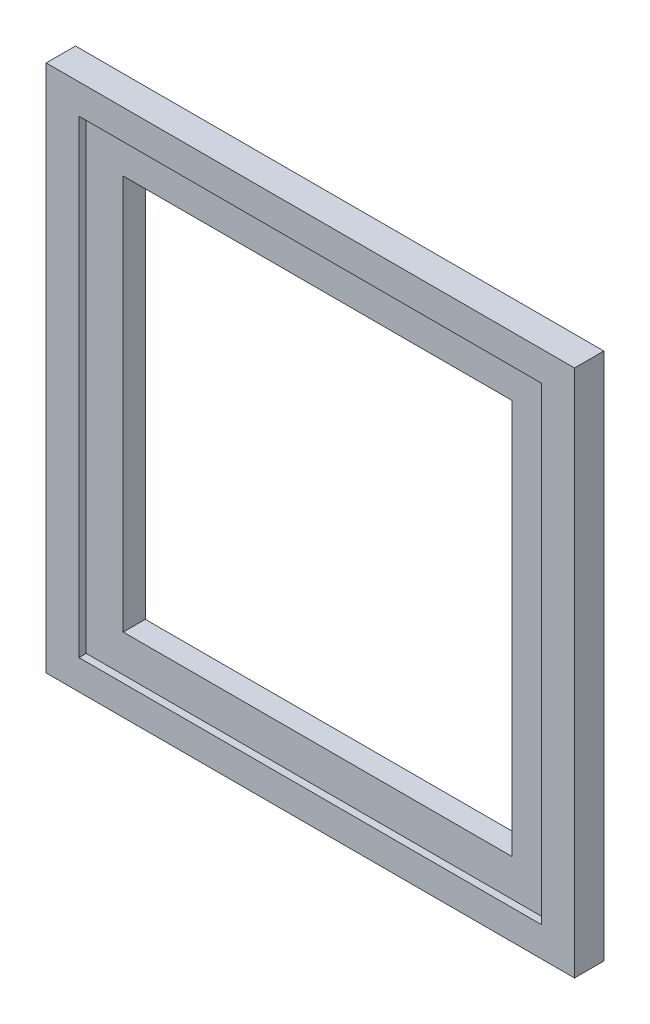
ISO-10303-21;
HEADER;
FILE_DESCRIPTION(('STEP AP214'),'2;1');
FILE_NAME('part.step','',(''),(''),'','','');
FILE_SCHEMA(('AUTOMOTIVE_DESIGN { 1 0 10303 214 1 1 1 1 }'));
ENDSEC;
DATA;
#1=APPLICATION_CONTEXT('core data for automotive mechanical design processes');
#2=APPLICATION_PROTOCOL_DEFINITION('international standard','automotive_design',2000,#1);
#3=PRODUCT_CONTEXT('',#1,'mechanical');
#4=PRODUCT('Part','Part','',(#3));
#5=PRODUCT_RELATED_PRODUCT_CATEGORY('part','',(#4));
#6=PRODUCT_DEFINITION_FORMATION('','',#4);
#7=PRODUCT_DEFINITION_CONTEXT('part definition',#1,'design');
#8=PRODUCT_DEFINITION('design','',#6,#7);
#9=PRODUCT_DEFINITION_SHAPE('','',#8);
#10=(LENGTH_UNIT() NAMED_UNIT(*) SI_UNIT(.MILLI.,.METRE.));
#11=(NAMED_UNIT(*) PLANE_ANGLE_UNIT() SI_UNIT($,.RADIAN.));
#12=(NAMED_UNIT(*) SI_UNIT($,.STERADIAN.) SOLID_ANGLE_UNIT());
#13=UNCERTAINTY_MEASURE_WITH_UNIT(LENGTH_MEASURE(1.E-05),#10,'distance_accuracy_value','');
#14=(GEOMETRIC_REPRESENTATION_CONTEXT(3) GLOBAL_UNCERTAINTY_ASSIGNED_CONTEXT((#13)) GLOBAL_UNIT_ASSIGNED_CONTEXT((#10,
#11,#12)) REPRESENTATION_CONTEXT('',''));
#15=CARTESIAN_POINT('',(0.,0.,0.));
#16=DIRECTION('',(0.,0.,1.));
#17=DIRECTION('',(1.,0.,0.));
#18=AXIS2_PLACEMENT_3D('',#15,#16,#17);
#19=CARTESIAN_POINT('',(-11.068156424581,64.9189944134078,6.35));
#20=DIRECTION('',(1.,0.,0.));
#21=DIRECTION('',(0.,1.,0.));
#22=AXIS2_PLACEMENT_3D('',#19,#20,#21);
#23=PLANE('',#22);
#24=DIRECTION('',(0.,-1.,0.));
#25=VECTOR('',#24,1.);
#26=CARTESIAN_POINT('',(-11.068156424581,64.9189944134078,0.));
#27=LINE('',#26,#25);
#28=CARTESIAN_POINT('',(-11.068156424581,64.9189944134078,0.));
#29=VERTEX_POINT('',#28);
#30=CARTESIAN_POINT('',(-11.068156424581,-49.3810055865922,0.));
#31=VERTEX_POINT('',#30);
#32=EDGE_CURVE('E198',#29,#31,#27,.T.);
#33=ORIENTED_EDGE('',*,*,#32,.T.);
#34=DIRECTION('',(0.,0.,-1.));
#35=VECTOR('',#34,1.);
#36=CARTESIAN_POINT('',(-11.068156424581,-49.3810055865922,6.35));
#37=LINE('',#36,#35);
#38=CARTESIAN_POINT('',(-11.068156424581,-49.3810055865922,6.35));
#39=VERTEX_POINT('',#38);
#40=EDGE_CURVE('E245',#39,#31,#37,.T.);
#41=ORIENTED_EDGE('',*,*,#40,.F.);
#42=DIRECTION('',(0.,-1.,0.));
#43=VECTOR('',#42,1.);
#44=CARTESIAN_POINT('',(-11.068156424581,64.9189944134078,6.35));
#45=LINE('',#44,#43);
#46=CARTESIAN_POINT('',(-11.068156424581,64.9189944134078,6.35));
#47=VERTEX_POINT('',#46);
#48=EDGE_CURVE('E208',#47,#39,#45,.T.);
#49=ORIENTED_EDGE('',*,*,#48,.F.);
#50=DIRECTION('',(0.,0.,-1.));
#51=VECTOR('',#50,1.);
#52=CARTESIAN_POINT('',(-11.068156424581,64.9189944134078,6.35));
#53=LINE('',#52,#51);
#54=EDGE_CURVE('E222',#47,#29,#53,.T.);
#55=ORIENTED_EDGE('',*,*,#54,.T.);
#56=EDGE_LOOP('',(#33,#41,#49,#55));
#57=FACE_BOUND('',#56,.T.);
#58=ADVANCED_FACE('F39',(#57),#23,.F.);
#59=CARTESIAN_POINT('',(-11.068156424581,-49.3810055865922,6.35));
#60=DIRECTION('',(0.,1.,0.));
#61=DIRECTION('',(-1.,0.,0.));
#62=AXIS2_PLACEMENT_3D('',#59,#60,#61);
#63=PLANE('',#62);
#64=DIRECTION('',(1.,0.,0.));
#65=VECTOR('',#64,1.);
#66=CARTESIAN_POINT('',(-11.068156424581,-49.3810055865922,0.));
#67=LINE('',#66,#65);
#68=CARTESIAN_POINT('',(103.231843575419,-49.3810055865922,0.));
#69=VERTEX_POINT('',#68);
#70=EDGE_CURVE('E226',#31,#69,#67,.T.);
#71=ORIENTED_EDGE('',*,*,#70,.T.);
#72=DIRECTION('',(0.,0.,-1.));
#73=VECTOR('',#72,1.);
#74=CARTESIAN_POINT('',(103.231843575419,-49.3810055865922,6.35));
#75=LINE('',#74,#73);
#76=CARTESIAN_POINT('',(103.231843575419,-49.3810055865922,6.35));
#77=VERTEX_POINT('',#76);
#78=EDGE_CURVE('E241',#77,#69,#75,.T.);
#79=ORIENTED_EDGE('',*,*,#78,.F.);
#80=DIRECTION('',(1.,0.,0.));
#81=VECTOR('',#80,1.);
#82=CARTESIAN_POINT('',(-11.068156424581,-49.3810055865922,6.35));
#83=LINE('',#82,#81);
#84=EDGE_CURVE('E212',#39,#77,#83,.T.);
#85=ORIENTED_EDGE('',*,*,#84,.F.);
#86=ORIENTED_EDGE('',*,*,#40,.T.);
#87=EDGE_LOOP('',(#71,#79,#85,#86));
#88=FACE_BOUND('',#87,.T.);
#89=ADVANCED_FACE('F272',(#88),#63,.F.);
#90=CARTESIAN_POINT('',(103.231843575419,64.9189944134078,6.35));
#91=DIRECTION('',(-1.,0.,0.));
#92=DIRECTION('',(0.,-1.,0.));
#93=AXIS2_PLACEMENT_3D('',#90,#91,#92);
#94=PLANE('',#93);
#95=DIRECTION('',(0.,1.,0.));
#96=VECTOR('',#95,1.);
#97=CARTESIAN_POINT('',(103.231843575419,64.9189944134078,0.));
#98=LINE('',#97,#96);
#99=CARTESIAN_POINT('',(103.231843575419,64.9189944134078,0.));
#100=VERTEX_POINT('',#99);
#101=EDGE_CURVE('E229',#69,#100,#98,.T.);
#102=ORIENTED_EDGE('',*,*,#101,.T.);
#103=DIRECTION('',(0.,0.,-1.));
#104=VECTOR('',#103,1.);
#105=CARTESIAN_POINT('',(103.231843575419,64.9189944134078,6.35));
#106=LINE('',#105,#104);
#107=CARTESIAN_POINT('',(103.231843575419,64.9189944134078,6.35));
#108=VERTEX_POINT('',#107);
#109=EDGE_CURVE('E237',#108,#100,#106,.T.);
#110=ORIENTED_EDGE('',*,*,#109,.F.);
#111=DIRECTION('',(0.,1.,0.));
#112=VECTOR('',#111,1.);
#113=CARTESIAN_POINT('',(103.231843575419,64.9189944134078,6.35));
#114=LINE('',#113,#112);
#115=EDGE_CURVE('E216',#77,#108,#114,.T.);
#116=ORIENTED_EDGE('',*,*,#115,.F.);
#117=ORIENTED_EDGE('',*,*,#78,.T.);
#118=EDGE_LOOP('',(#102,#110,#116,#117));
#119=FACE_BOUND('',#118,.T.);
#120=ADVANCED_FACE('F277',(#119),#94,.F.);
#121=CARTESIAN_POINT('',(-11.068156424581,64.9189944134078,6.35));
#122=DIRECTION('',(0.,-1.,0.));
#123=DIRECTION('',(0.,0.,-1.));
#124=AXIS2_PLACEMENT_3D('',#121,#122,#123);
#125=PLANE('',#124);
#126=DIRECTION('',(-1.,0.,0.));
#127=VECTOR('',#126,1.);
#128=CARTESIAN_POINT('',(-11.068156424581,64.9189944134078,0.));
#129=LINE('',#128,#127);
#130=EDGE_CURVE('E213',#100,#29,#129,.T.);
#131=ORIENTED_EDGE('',*,*,#130,.T.);
#132=ORIENTED_EDGE('',*,*,#54,.F.);
#133=DIRECTION('',(-1.,0.,0.));
#134=VECTOR('',#133,1.);
#135=CARTESIAN_POINT('',(-11.068156424581,64.9189944134078,6.35));
#136=LINE('',#135,#134);
#137=EDGE_CURVE('E219',#108,#47,#136,.T.);
#138=ORIENTED_EDGE('',*,*,#137,.F.);
#139=ORIENTED_EDGE('',*,*,#109,.T.);
#140=EDGE_LOOP('',(#131,#132,#138,#139));
#141=FACE_BOUND('',#140,.T.);
#142=ADVANCED_FACE('F292',(#141),#125,.F.);
#143=CARTESIAN_POINT('',(0.,0.,6.35));
#144=DIRECTION('',(0.,0.,1.));
#145=DIRECTION('',(1.,0.,0.));
#146=AXIS2_PLACEMENT_3D('',#143,#144,#145);
#147=PLANE('',#146);
#148=DIRECTION('',(0.,-1.,0.));
#149=VECTOR('',#148,1.);
#150=CARTESIAN_POINT('',(-3.97815642458102,58.4939944134078,6.35));
#151=LINE('',#150,#149);
#152=CARTESIAN_POINT('',(-3.97815642458102,58.4939944134078,6.35));
#153=VERTEX_POINT('',#152);
#154=CARTESIAN_POINT('',(-3.97815642458101,-42.9560055865922,6.35));
#155=VERTEX_POINT('',#154);
#156=EDGE_CURVE('E157',#153,#155,#151,.T.);
#157=ORIENTED_EDGE('',*,*,#156,.F.);
#158=DIRECTION('',(-1.,0.,0.));
#159=VECTOR('',#158,1.);
#160=CARTESIAN_POINT('',(-3.97815642458102,58.4939944134078,6.35));
#161=LINE('',#160,#159);
#162=CARTESIAN_POINT('',(96.141843575419,58.4939944134078,6.35));
#163=VERTEX_POINT('',#162);
#164=EDGE_CURVE('E169',#163,#153,#161,.T.);
#165=ORIENTED_EDGE('',*,*,#164,.F.);
#166=DIRECTION('',(0.,1.,0.));
#167=VECTOR('',#166,1.);
#168=CARTESIAN_POINT('',(96.141843575419,58.4939944134078,6.35));
#169=LINE('',#168,#167);
#170=CARTESIAN_POINT('',(96.141843575419,-42.9560055865922,6.35));
#171=VERTEX_POINT('',#170);
#172=EDGE_CURVE('E188',#171,#163,#169,.T.);
#173=ORIENTED_EDGE('',*,*,#172,.F.);
#174=DIRECTION('',(1.,0.,0.));
#175=VECTOR('',#174,1.);
#176=CARTESIAN_POINT('',(-3.97815642458101,-42.9560055865922,6.35));
#177=LINE('',#176,#175);
#178=EDGE_CURVE('E184',#155,#171,#177,.T.);
#179=ORIENTED_EDGE('',*,*,#178,.F.);
#180=EDGE_LOOP('',(#157,#165,#173,#179));
#181=FACE_BOUND('',#180,.T.);
#182=ORIENTED_EDGE('',*,*,#48,.T.);
#183=ORIENTED_EDGE('',*,*,#84,.T.);
#184=ORIENTED_EDGE('',*,*,#115,.T.);
#185=ORIENTED_EDGE('',*,*,#137,.T.);
#186=EDGE_LOOP('',(#182,#183,#184,#185));
#187=FACE_BOUND('',#186,.T.);
#188=ADVANCED_FACE('F288',(#181,#187),#147,.T.);
#189=CARTESIAN_POINT('',(0.,0.,0.));
#190=DIRECTION('',(0.,0.,1.));
#191=DIRECTION('',(1.,0.,0.));
#192=AXIS2_PLACEMENT_3D('',#189,#190,#191);
#193=PLANE('',#192);
#194=DIRECTION('',(0.,1.,0.));
#195=VECTOR('',#194,1.);
#196=CARTESIAN_POINT('',(88.141843575419,50.4939944134078,0.));
#197=LINE('',#196,#195);
#198=CARTESIAN_POINT('',(88.141843575419,-34.9560055865922,0.));
#199=VERTEX_POINT('',#198);
#200=CARTESIAN_POINT('',(88.141843575419,50.4939944134078,0.));
#201=VERTEX_POINT('',#200);
#202=EDGE_CURVE('E136',#199,#201,#197,.T.);
#203=ORIENTED_EDGE('',*,*,#202,.T.);
#204=DIRECTION('',(-1.,0.,0.));
#205=VECTOR('',#204,1.);
#206=CARTESIAN_POINT('',(4.02184357541898,50.4939944134078,0.));
#207=LINE('',#206,#205);
#208=CARTESIAN_POINT('',(4.02184357541898,50.4939944134078,0.));
#209=VERTEX_POINT('',#208);
#210=EDGE_CURVE('E130',#201,#209,#207,.T.);
#211=ORIENTED_EDGE('',*,*,#210,.T.);
#212=DIRECTION('',(0.,-1.,0.));
#213=VECTOR('',#212,1.);
#214=CARTESIAN_POINT('',(4.02184357541898,50.4939944134078,0.));
#215=LINE('',#214,#213);
#216=CARTESIAN_POINT('',(4.02184357541898,-34.9560055865922,0.));
#217=VERTEX_POINT('',#216);
#218=EDGE_CURVE('E139',#209,#217,#215,.T.);
#219=ORIENTED_EDGE('',*,*,#218,.T.);
#220=DIRECTION('',(1.,0.,0.));
#221=VECTOR('',#220,1.);
#222=CARTESIAN_POINT('',(4.02184357541898,-34.9560055865922,0.));
#223=LINE('',#222,#221);
#224=EDGE_CURVE('E54',#217,#199,#223,.T.);
#225=ORIENTED_EDGE('',*,*,#224,.T.);
#226=EDGE_LOOP('',(#203,#211,#219,#225));
#227=FACE_BOUND('',#226,.T.);
#228=ORIENTED_EDGE('',*,*,#32,.F.);
#229=ORIENTED_EDGE('',*,*,#130,.F.);
#230=ORIENTED_EDGE('',*,*,#101,.F.);
#231=ORIENTED_EDGE('',*,*,#70,.F.);
#232=EDGE_LOOP('',(#228,#229,#230,#231));
#233=FACE_BOUND('',#232,.T.);
#234=ADVANCED_FACE('F144',(#227,#233),#193,.F.);
#235=CARTESIAN_POINT('',(-3.97815642458102,58.4939944134078,4.7752));
#236=DIRECTION('',(-1.,0.,0.));
#237=DIRECTION('',(0.,-1.,0.));
#238=AXIS2_PLACEMENT_3D('',#235,#236,#237);
#239=PLANE('',#238);
#240=ORIENTED_EDGE('',*,*,#156,.T.);
#241=DIRECTION('',(0.,0.,1.));
#242=VECTOR('',#241,1.);
#243=CARTESIAN_POINT('',(-3.97815642458101,-42.9560055865922,4.7752));
#244=LINE('',#243,#242);
#245=CARTESIAN_POINT('',(-3.97815642458101,-42.9560055865922,4.7752));
#246=VERTEX_POINT('',#245);
#247=EDGE_CURVE('E181',#246,#155,#244,.T.);
#248=ORIENTED_EDGE('',*,*,#247,.F.);
#249=DIRECTION('',(0.,-1.,0.));
#250=VECTOR('',#249,1.);
#251=CARTESIAN_POINT('',(-3.97815642458102,58.4939944134078,4.7752));
#252=LINE('',#251,#250);
#253=CARTESIAN_POINT('',(-3.97815642458102,58.4939944134078,4.7752));
#254=VERTEX_POINT('',#253);
#255=EDGE_CURVE('E164',#254,#246,#252,.T.);
#256=ORIENTED_EDGE('',*,*,#255,.F.);
#257=DIRECTION('',(0.,0.,1.));
#258=VECTOR('',#257,1.);
#259=CARTESIAN_POINT('',(-3.97815642458102,58.4939944134078,4.7752));
#260=LINE('',#259,#258);
#261=EDGE_CURVE('E195',#254,#153,#260,.T.);
#262=ORIENTED_EDGE('',*,*,#261,.T.);
#263=EDGE_LOOP('',(#240,#248,#256,#262));
#264=FACE_BOUND('',#263,.T.);
#265=ADVANCED_FACE('F303',(#264),#239,.F.);
#266=CARTESIAN_POINT('',(-3.97815642458102,58.4939944134078,4.7752));
#267=DIRECTION('',(0.,1.,0.));
#268=DIRECTION('',(0.,0.,1.));
#269=AXIS2_PLACEMENT_3D('',#266,#267,#268);
#270=PLANE('',#269);
#271=ORIENTED_EDGE('',*,*,#164,.T.);
#272=ORIENTED_EDGE('',*,*,#261,.F.);
#273=DIRECTION('',(-1.,0.,0.));
#274=VECTOR('',#273,1.);
#275=CARTESIAN_POINT('',(-3.97815642458102,58.4939944134078,4.7752));
#276=LINE('',#275,#274);
#277=CARTESIAN_POINT('',(96.141843575419,58.4939944134078,4.7752));
#278=VERTEX_POINT('',#277);
#279=EDGE_CURVE('E177',#278,#254,#276,.T.);
#280=ORIENTED_EDGE('',*,*,#279,.F.);
#281=DIRECTION('',(0.,0.,1.));
#282=VECTOR('',#281,1.);
#283=CARTESIAN_POINT('',(96.141843575419,58.4939944134078,4.7752));
#284=LINE('',#283,#282);
#285=EDGE_CURVE('E199',#278,#163,#284,.T.);
#286=ORIENTED_EDGE('',*,*,#285,.T.);
#287=EDGE_LOOP('',(#271,#272,#280,#286));
#288=FACE_BOUND('',#287,.T.);
#289=ADVANCED_FACE('F309',(#288),#270,.F.);
#290=CARTESIAN_POINT('',(96.141843575419,58.4939944134078,4.7752));
#291=DIRECTION('',(1.,0.,0.));
#292=DIRECTION('',(0.,1.,0.));
#293=AXIS2_PLACEMENT_3D('',#290,#291,#292);
#294=PLANE('',#293);
#295=ORIENTED_EDGE('',*,*,#172,.T.);
#296=ORIENTED_EDGE('',*,*,#285,.F.);
#297=DIRECTION('',(0.,1.,0.));
#298=VECTOR('',#297,1.);
#299=CARTESIAN_POINT('',(96.141843575419,58.4939944134078,4.7752));
#300=LINE('',#299,#298);
#301=CARTESIAN_POINT('',(96.141843575419,-42.9560055865922,4.7752));
#302=VERTEX_POINT('',#301);
#303=EDGE_CURVE('E173',#302,#278,#300,.T.);
#304=ORIENTED_EDGE('',*,*,#303,.F.);
#305=DIRECTION('',(0.,0.,1.));
#306=VECTOR('',#305,1.);
#307=CARTESIAN_POINT('',(96.141843575419,-42.9560055865922,4.7752));
#308=LINE('',#307,#306);
#309=EDGE_CURVE('E202',#302,#171,#308,.T.);
#310=ORIENTED_EDGE('',*,*,#309,.T.);
#311=EDGE_LOOP('',(#295,#296,#304,#310));
#312=FACE_BOUND('',#311,.T.);
#313=ADVANCED_FACE('F314',(#312),#294,.F.);
#314=CARTESIAN_POINT('',(-3.97815642458101,-42.9560055865922,4.7752));
#315=DIRECTION('',(0.,-1.,0.));
#316=DIRECTION('',(0.,0.,-1.));
#317=AXIS2_PLACEMENT_3D('',#314,#315,#316);
#318=PLANE('',#317);
#319=ORIENTED_EDGE('',*,*,#178,.T.);
#320=ORIENTED_EDGE('',*,*,#309,.F.);
#321=DIRECTION('',(1.,0.,0.));
#322=VECTOR('',#321,1.);
#323=CARTESIAN_POINT('',(-3.97815642458101,-42.9560055865922,4.7752));
#324=LINE('',#323,#322);
#325=EDGE_CURVE('E168',#246,#302,#324,.T.);
#326=ORIENTED_EDGE('',*,*,#325,.F.);
#327=ORIENTED_EDGE('',*,*,#247,.T.);
#328=EDGE_LOOP('',(#319,#320,#326,#327));
#329=FACE_BOUND('',#328,.T.);
#330=ADVANCED_FACE('F311',(#329),#318,.F.);
#331=CARTESIAN_POINT('',(0.,0.,4.7752));
#332=DIRECTION('',(0.,0.,1.));
#333=DIRECTION('',(1.,0.,0.));
#334=AXIS2_PLACEMENT_3D('',#331,#332,#333);
#335=PLANE('',#334);
#336=DIRECTION('',(-1.,0.,0.));
#337=VECTOR('',#336,1.);
#338=CARTESIAN_POINT('',(0.,50.4939944134078,4.7752));
#339=LINE('',#338,#337);
#340=CARTESIAN_POINT('',(88.141843575419,50.4939944134078,4.7752));
#341=VERTEX_POINT('',#340);
#342=CARTESIAN_POINT('',(4.02184357541898,50.4939944134078,4.7752));
#343=VERTEX_POINT('',#342);
#344=EDGE_CURVE('E11',#341,#343,#339,.T.);
#345=ORIENTED_EDGE('',*,*,#344,.F.);
#346=DIRECTION('',(0.,1.,0.));
#347=VECTOR('',#346,1.);
#348=CARTESIAN_POINT('',(88.141843575419,0.,4.7752));
#349=LINE('',#348,#347);
#350=CARTESIAN_POINT('',(88.141843575419,-34.9560055865922,4.7752));
#351=VERTEX_POINT('',#350);
#352=EDGE_CURVE('E47',#351,#341,#349,.T.);
#353=ORIENTED_EDGE('',*,*,#352,.F.);
#354=DIRECTION('',(1.,0.,0.));
#355=VECTOR('',#354,1.);
#356=CARTESIAN_POINT('',(0.,-34.9560055865922,4.7752));
#357=LINE('',#356,#355);
#358=CARTESIAN_POINT('',(4.02184357541898,-34.9560055865922,4.7752));
#359=VERTEX_POINT('',#358);
#360=EDGE_CURVE('E252',#359,#351,#357,.T.);
#361=ORIENTED_EDGE('',*,*,#360,.F.);
#362=DIRECTION('',(0.,-1.,0.));
#363=VECTOR('',#362,1.);
#364=CARTESIAN_POINT('',(4.02184357541898,0.,4.7752));
#365=LINE('',#364,#363);
#366=EDGE_CURVE('E249',#343,#359,#365,.T.);
#367=ORIENTED_EDGE('',*,*,#366,.F.);
#368=EDGE_LOOP('',(#345,#353,#361,#367));
#369=FACE_BOUND('',#368,.T.);
#370=ORIENTED_EDGE('',*,*,#255,.T.);
#371=ORIENTED_EDGE('',*,*,#325,.T.);
#372=ORIENTED_EDGE('',*,*,#303,.T.);
#373=ORIENTED_EDGE('',*,*,#279,.T.);
#374=EDGE_LOOP('',(#370,#371,#372,#373));
#375=FACE_BOUND('',#374,.T.);
#376=ADVANCED_FACE('F260',(#369,#375),#335,.T.);
#377=CARTESIAN_POINT('',(4.02184357541898,50.4939944134078,0.));
#378=DIRECTION('',(0.,1.,0.));
#379=DIRECTION('',(0.,0.,1.));
#380=AXIS2_PLACEMENT_3D('',#377,#378,#379);
#381=PLANE('',#380);
#382=ORIENTED_EDGE('',*,*,#344,.T.);
#383=DIRECTION('',(0.,0.,1.));
#384=VECTOR('',#383,1.);
#385=CARTESIAN_POINT('',(4.02184357541898,50.4939944134078,0.));
#386=LINE('',#385,#384);
#387=EDGE_CURVE('E62',#209,#343,#386,.T.);
#388=ORIENTED_EDGE('',*,*,#387,.F.);
#389=ORIENTED_EDGE('',*,*,#210,.F.);
#390=DIRECTION('',(0.,0.,1.));
#391=VECTOR('',#390,1.);
#392=CARTESIAN_POINT('',(88.141843575419,50.4939944134078,0.));
#393=LINE('',#392,#391);
#394=EDGE_CURVE('E154',#201,#341,#393,.T.);
#395=ORIENTED_EDGE('',*,*,#394,.T.);
#396=EDGE_LOOP('',(#382,#388,#389,#395));
#397=FACE_BOUND('',#396,.T.);
#398=ADVANCED_FACE('F127',(#397),#381,.F.);
#399=CARTESIAN_POINT('',(88.141843575419,50.4939944134078,0.));
#400=DIRECTION('',(1.,0.,0.));
#401=DIRECTION('',(0.,0.,-1.));
#402=AXIS2_PLACEMENT_3D('',#399,#400,#401);
#403=PLANE('',#402);
#404=ORIENTED_EDGE('',*,*,#352,.T.);
#405=ORIENTED_EDGE('',*,*,#394,.F.);
#406=ORIENTED_EDGE('',*,*,#202,.F.);
#407=DIRECTION('',(0.,0.,1.));
#408=VECTOR('',#407,1.);
#409=CARTESIAN_POINT('',(88.141843575419,-34.9560055865922,0.));
#410=LINE('',#409,#408);
#411=EDGE_CURVE('E158',#199,#351,#410,.T.);
#412=ORIENTED_EDGE('',*,*,#411,.T.);
#413=EDGE_LOOP('',(#404,#405,#406,#412));
#414=FACE_BOUND('',#413,.T.);
#415=ADVANCED_FACE('F257',(#414),#403,.F.);
#416=CARTESIAN_POINT('',(4.02184357541898,-34.9560055865922,0.));
#417=DIRECTION('',(0.,-1.,0.));
#418=DIRECTION('',(1.,0.,0.));
#419=AXIS2_PLACEMENT_3D('',#416,#417,#418);
#420=PLANE('',#419);
#421=ORIENTED_EDGE('',*,*,#360,.T.);
#422=ORIENTED_EDGE('',*,*,#411,.F.);
#423=ORIENTED_EDGE('',*,*,#224,.F.);
#424=DIRECTION('',(0.,0.,1.));
#425=VECTOR('',#424,1.);
#426=CARTESIAN_POINT('',(4.02184357541898,-34.9560055865922,0.));
#427=LINE('',#426,#425);
#428=EDGE_CURVE('E135',#217,#359,#427,.T.);
#429=ORIENTED_EDGE('',*,*,#428,.T.);
#430=EDGE_LOOP('',(#421,#422,#423,#429));
#431=FACE_BOUND('',#430,.T.);
#432=ADVANCED_FACE('F262',(#431),#420,.F.);
#433=CARTESIAN_POINT('',(4.02184357541898,50.4939944134078,0.));
#434=DIRECTION('',(-1.,0.,0.));
#435=DIRECTION('',(0.,0.,1.));
#436=AXIS2_PLACEMENT_3D('',#433,#434,#435);
#437=PLANE('',#436);
#438=ORIENTED_EDGE('',*,*,#366,.T.);
#439=ORIENTED_EDGE('',*,*,#428,.F.);
#440=ORIENTED_EDGE('',*,*,#218,.F.);
#441=ORIENTED_EDGE('',*,*,#387,.T.);
#442=EDGE_LOOP('',(#438,#439,#440,#441));
#443=FACE_BOUND('',#442,.T.);
#444=ADVANCED_FACE('F140',(#443),#437,.F.);
#445=CLOSED_SHELL('',(#58,#89,#120,#142,#188,#234,#265,#289,#313,#330,#376,#398,#415,#432,#444));
#446=MANIFOLD_SOLID_BREP('B2',#445);
#447=ADVANCED_BREP_SHAPE_REPRESENTATION('',(#18,#446),#14);
#448=SHAPE_DEFINITION_REPRESENTATION(#9,#447);
ENDSEC;
END-ISO-10303-21;
